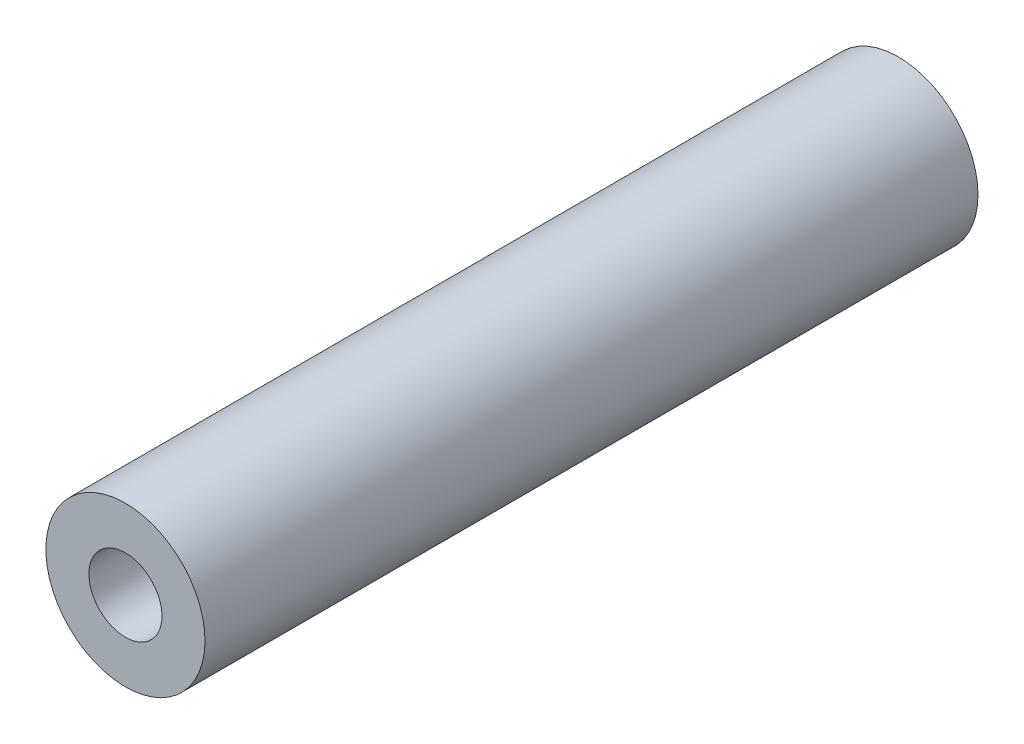
ISO-10303-21;
HEADER;
FILE_DESCRIPTION(('STEP AP214'),'2;1');
FILE_NAME('part.step','',(''),(''),'','','');
FILE_SCHEMA(('AUTOMOTIVE_DESIGN { 1 0 10303 214 1 1 1 1 }'));
ENDSEC;
DATA;
#1=APPLICATION_CONTEXT('core data for automotive mechanical design processes');
#2=APPLICATION_PROTOCOL_DEFINITION('international standard','automotive_design',2000,#1);
#3=PRODUCT_CONTEXT('',#1,'mechanical');
#4=PRODUCT('Part','Part','',(#3));
#5=PRODUCT_RELATED_PRODUCT_CATEGORY('part','',(#4));
#6=PRODUCT_DEFINITION_FORMATION('','',#4);
#7=PRODUCT_DEFINITION_CONTEXT('part definition',#1,'design');
#8=PRODUCT_DEFINITION('design','',#6,#7);
#9=PRODUCT_DEFINITION_SHAPE('','',#8);
#10=(LENGTH_UNIT() NAMED_UNIT(*) SI_UNIT(.MILLI.,.METRE.));
#11=(NAMED_UNIT(*) PLANE_ANGLE_UNIT() SI_UNIT($,.RADIAN.));
#12=(NAMED_UNIT(*) SI_UNIT($,.STERADIAN.) SOLID_ANGLE_UNIT());
#13=UNCERTAINTY_MEASURE_WITH_UNIT(LENGTH_MEASURE(1.E-05),#10,'distance_accuracy_value','');
#14=(GEOMETRIC_REPRESENTATION_CONTEXT(3) GLOBAL_UNCERTAINTY_ASSIGNED_CONTEXT((#13)) GLOBAL_UNIT_ASSIGNED_CONTEXT((#10,
#11,#12)) REPRESENTATION_CONTEXT('',''));
#15=CARTESIAN_POINT('',(0.,0.,0.));
#16=DIRECTION('',(0.,0.,1.));
#17=DIRECTION('',(1.,0.,0.));
#18=AXIS2_PLACEMENT_3D('',#15,#16,#17);
#19=CARTESIAN_POINT('',(0.,0.,53.975));
#20=DIRECTION('',(0.,0.,1.));
#21=DIRECTION('',(1.,0.,0.));
#22=AXIS2_PLACEMENT_3D('',#19,#20,#21);
#23=PLANE('',#22);
#24=CARTESIAN_POINT('',(0.,0.,53.975));
#25=DIRECTION('',(0.,0.,1.));
#26=DIRECTION('',(1.,0.,0.));
#27=AXIS2_PLACEMENT_3D('',#24,#25,#26);
#28=CIRCLE('',#27,5.55625);
#29=CARTESIAN_POINT('',(5.55625,0.,53.975));
#30=VERTEX_POINT('',#29);
#31=EDGE_CURVE('E12',#30,#30,#28,.T.);
#32=ORIENTED_EDGE('',*,*,#31,.T.);
#33=EDGE_LOOP('',(#32));
#34=FACE_BOUND('',#33,.T.);
#35=CARTESIAN_POINT('',(0.,0.,53.975));
#36=DIRECTION('',(0.,0.,1.));
#37=DIRECTION('',(1.,0.,0.));
#38=AXIS2_PLACEMENT_3D('',#35,#36,#37);
#39=CIRCLE('',#38,2.5527);
#40=CARTESIAN_POINT('',(2.5527,0.,53.975));
#41=VERTEX_POINT('',#40);
#42=EDGE_CURVE('E66',#41,#41,#39,.T.);
#43=ORIENTED_EDGE('',*,*,#42,.F.);
#44=EDGE_LOOP('',(#43));
#45=FACE_BOUND('',#44,.T.);
#46=ADVANCED_FACE('F51',(#34,#45),#23,.T.);
#47=CARTESIAN_POINT('',(0.,0.,0.));
#48=DIRECTION('',(0.,0.,1.));
#49=DIRECTION('',(1.,0.,0.));
#50=AXIS2_PLACEMENT_3D('',#47,#48,#49);
#51=PLANE('',#50);
#52=CARTESIAN_POINT('',(0.,0.,0.));
#53=DIRECTION('',(0.,0.,1.));
#54=DIRECTION('',(1.,0.,0.));
#55=AXIS2_PLACEMENT_3D('',#52,#53,#54);
#56=CIRCLE('',#55,5.55625);
#57=CARTESIAN_POINT('',(5.55625,0.,0.));
#58=VERTEX_POINT('',#57);
#59=EDGE_CURVE('E55',#58,#58,#56,.T.);
#60=ORIENTED_EDGE('',*,*,#59,.F.);
#61=EDGE_LOOP('',(#60));
#62=FACE_BOUND('',#61,.T.);
#63=CARTESIAN_POINT('',(0.,0.,0.));
#64=DIRECTION('',(0.,0.,1.));
#65=DIRECTION('',(1.,0.,0.));
#66=AXIS2_PLACEMENT_3D('',#63,#64,#65);
#67=CIRCLE('',#66,2.5527);
#68=CARTESIAN_POINT('',(2.5527,0.,0.));
#69=VERTEX_POINT('',#68);
#70=EDGE_CURVE('E68',#69,#69,#67,.T.);
#71=ORIENTED_EDGE('',*,*,#70,.T.);
#72=EDGE_LOOP('',(#71));
#73=FACE_BOUND('',#72,.T.);
#74=ADVANCED_FACE('F82',(#62,#73),#51,.F.);
#75=CARTESIAN_POINT('',(0.,0.,53.975));
#76=DIRECTION('',(0.,0.,-1.));
#77=DIRECTION('',(-1.,0.,0.));
#78=AXIS2_PLACEMENT_3D('',#75,#76,#77);
#79=CYLINDRICAL_SURFACE('',#78,5.55625);
#80=ORIENTED_EDGE('',*,*,#31,.F.);
#81=EDGE_LOOP('',(#80));
#82=FACE_BOUND('',#81,.T.);
#83=ORIENTED_EDGE('',*,*,#59,.T.);
#84=EDGE_LOOP('',(#83));
#85=FACE_BOUND('',#84,.T.);
#86=ADVANCED_FACE('F53',(#82,#85),#79,.T.);
#87=CARTESIAN_POINT('',(0.,0.,53.975));
#88=DIRECTION('',(0.,0.,-1.));
#89=DIRECTION('',(-1.,0.,0.));
#90=AXIS2_PLACEMENT_3D('',#87,#88,#89);
#91=CYLINDRICAL_SURFACE('',#90,2.5527);
#92=ORIENTED_EDGE('',*,*,#42,.T.);
#93=EDGE_LOOP('',(#92));
#94=FACE_BOUND('',#93,.T.);
#95=ORIENTED_EDGE('',*,*,#70,.F.);
#96=EDGE_LOOP('',(#95));
#97=FACE_BOUND('',#96,.T.);
#98=ADVANCED_FACE('F78',(#94,#97),#91,.F.);
#99=CLOSED_SHELL('',(#46,#74,#86,#98));
#100=MANIFOLD_SOLID_BREP('B2',#99);
#101=ADVANCED_BREP_SHAPE_REPRESENTATION('',(#18,#100),#14);
#102=SHAPE_DEFINITION_REPRESENTATION(#9,#101);
ENDSEC;
END-ISO-10303-21;
